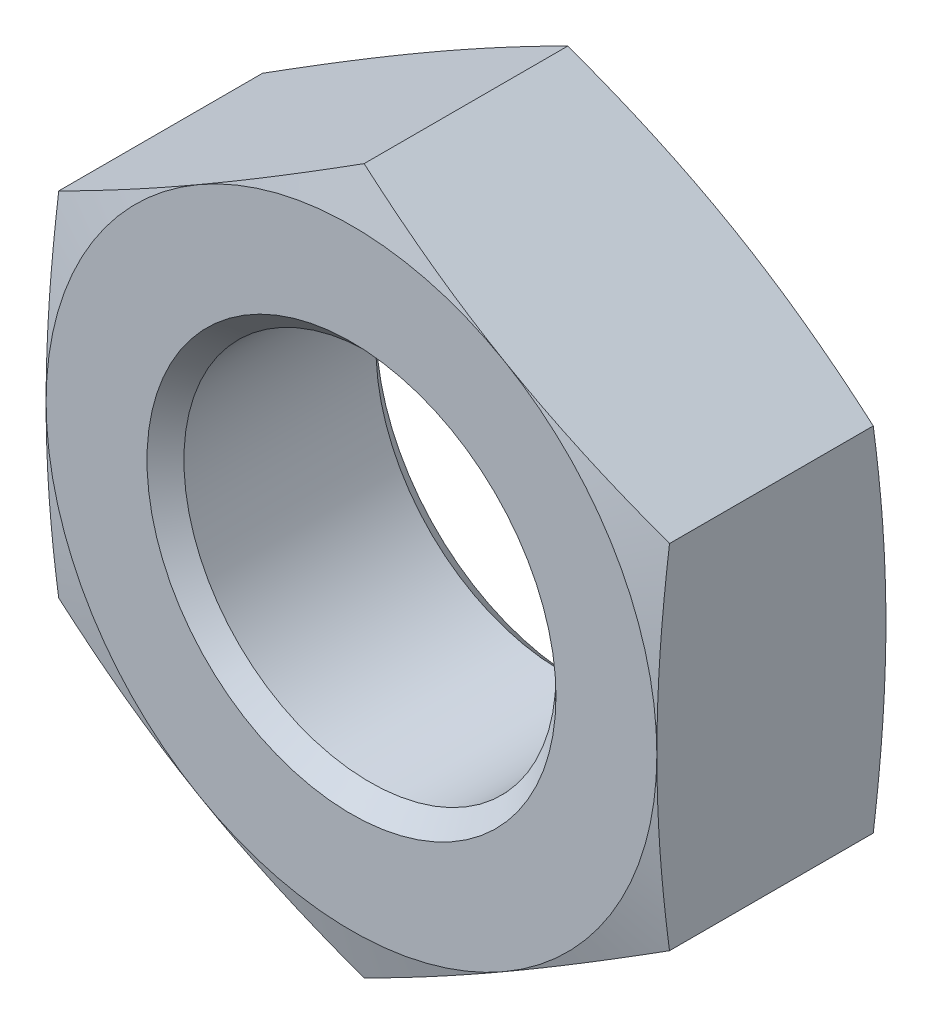
ISO-10303-21;
HEADER;
FILE_DESCRIPTION(('STEP AP214'),'2;1');
FILE_NAME('part.step','',(''),(''),'','','');
FILE_SCHEMA(('AUTOMOTIVE_DESIGN { 1 0 10303 214 1 1 1 1 }'));
ENDSEC;
DATA;
#1=APPLICATION_CONTEXT('core data for automotive mechanical design processes');
#2=APPLICATION_PROTOCOL_DEFINITION('international standard','automotive_design',2000,#1);
#3=PRODUCT_CONTEXT('',#1,'mechanical');
#4=PRODUCT('Part','Part','',(#3));
#5=PRODUCT_RELATED_PRODUCT_CATEGORY('part','',(#4));
#6=PRODUCT_DEFINITION_FORMATION('','',#4);
#7=PRODUCT_DEFINITION_CONTEXT('part definition',#1,'design');
#8=PRODUCT_DEFINITION('design','',#6,#7);
#9=PRODUCT_DEFINITION_SHAPE('','',#8);
#10=(LENGTH_UNIT() NAMED_UNIT(*) SI_UNIT(.MILLI.,.METRE.));
#11=(NAMED_UNIT(*) PLANE_ANGLE_UNIT() SI_UNIT($,.RADIAN.));
#12=(NAMED_UNIT(*) SI_UNIT($,.STERADIAN.) SOLID_ANGLE_UNIT());
#13=UNCERTAINTY_MEASURE_WITH_UNIT(LENGTH_MEASURE(1.E-05),#10,'distance_accuracy_value','');
#14=(GEOMETRIC_REPRESENTATION_CONTEXT(3) GLOBAL_UNCERTAINTY_ASSIGNED_CONTEXT((#13)) GLOBAL_UNIT_ASSIGNED_CONTEXT((#10,
#11,#12)) REPRESENTATION_CONTEXT('',''));
#15=CARTESIAN_POINT('',(0.,0.,0.));
#16=DIRECTION('',(0.,0.,1.));
#17=DIRECTION('',(1.,0.,0.));
#18=AXIS2_PLACEMENT_3D('',#15,#16,#17);
#19=CARTESIAN_POINT('',(0.,0.,0.));
#20=DIRECTION('',(0.,0.,-1.));
#21=DIRECTION('',(-1.,0.,0.));
#22=AXIS2_PLACEMENT_3D('',#19,#20,#21);
#23=PLANE('',#22);
#24=CARTESIAN_POINT('',(0.,0.,0.));
#25=DIRECTION('',(0.,0.,1.));
#26=DIRECTION('',(1.,0.,0.));
#27=AXIS2_PLACEMENT_3D('',#24,#25,#26);
#28=CIRCLE('',#27,14.224);
#29=CARTESIAN_POINT('',(14.224,0.,0.));
#30=VERTEX_POINT('',#29);
#31=CARTESIAN_POINT('',(7.11199999999961,12.3183453434298,0.));
#32=VERTEX_POINT('',#31);
#33=EDGE_CURVE('E11',#30,#32,#28,.T.);
#34=ORIENTED_EDGE('',*,*,#33,.T.);
#35=CARTESIAN_POINT('',(-7.11199999999961,12.3183453434298,0.));
#36=VERTEX_POINT('',#35);
#37=EDGE_CURVE('E44',#32,#36,#28,.T.);
#38=ORIENTED_EDGE('',*,*,#37,.T.);
#39=CARTESIAN_POINT('',(-14.224,0.,0.));
#40=VERTEX_POINT('',#39);
#41=EDGE_CURVE('E329',#36,#40,#28,.T.);
#42=ORIENTED_EDGE('',*,*,#41,.T.);
#43=CARTESIAN_POINT('',(-7.11199999999961,-12.3183453434298,0.));
#44=VERTEX_POINT('',#43);
#45=EDGE_CURVE('E322',#40,#44,#28,.T.);
#46=ORIENTED_EDGE('',*,*,#45,.T.);
#47=CARTESIAN_POINT('',(7.11199999999961,-12.3183453434298,0.));
#48=VERTEX_POINT('',#47);
#49=EDGE_CURVE('E325',#44,#48,#28,.T.);
#50=ORIENTED_EDGE('',*,*,#49,.T.);
#51=EDGE_CURVE('E45',#48,#30,#28,.T.);
#52=ORIENTED_EDGE('',*,*,#51,.T.);
#53=EDGE_LOOP('',(#34,#38,#42,#46,#50,#52));
#54=FACE_BOUND('',#53,.T.);
#55=CARTESIAN_POINT('',(0.,0.,0.));
#56=DIRECTION('',(0.,0.,1.));
#57=DIRECTION('',(1.,0.,0.));
#58=AXIS2_PLACEMENT_3D('',#55,#56,#57);
#59=CIRCLE('',#58,9.525);
#60=CARTESIAN_POINT('',(9.525,0.,0.));
#61=VERTEX_POINT('',#60);
#62=EDGE_CURVE('E186',#61,#61,#59,.T.);
#63=ORIENTED_EDGE('',*,*,#62,.F.);
#64=EDGE_LOOP('',(#63));
#65=FACE_BOUND('',#64,.T.);
#66=ADVANCED_FACE('F37',(#54,#65),#23,.F.);
#67=CARTESIAN_POINT('',(0.,14.224,-10.668));
#68=DIRECTION('',(0.,0.,1.));
#69=DIRECTION('',(1.,0.,0.));
#70=AXIS2_PLACEMENT_3D('',#67,#68,#69);
#71=PLANE('',#70);
#72=CARTESIAN_POINT('',(0.,0.,-10.668));
#73=DIRECTION('',(0.,0.,1.));
#74=DIRECTION('',(1.,0.,0.));
#75=AXIS2_PLACEMENT_3D('',#72,#73,#74);
#76=CIRCLE('',#75,14.224);
#77=CARTESIAN_POINT('',(14.224,0.,-10.668));
#78=VERTEX_POINT('',#77);
#79=CARTESIAN_POINT('',(7.11199999999961,12.3183453434298,-10.668));
#80=VERTEX_POINT('',#79);
#81=EDGE_CURVE('E360',#78,#80,#76,.T.);
#82=ORIENTED_EDGE('',*,*,#81,.F.);
#83=CARTESIAN_POINT('',(7.1119999999996,-12.3183453434298,-10.668));
#84=VERTEX_POINT('',#83);
#85=EDGE_CURVE('E363',#84,#78,#76,.T.);
#86=ORIENTED_EDGE('',*,*,#85,.F.);
#87=CARTESIAN_POINT('',(-7.1119999999996,-12.3183453434298,-10.668));
#88=VERTEX_POINT('',#87);
#89=EDGE_CURVE('E364',#88,#84,#76,.T.);
#90=ORIENTED_EDGE('',*,*,#89,.F.);
#91=CARTESIAN_POINT('',(-14.224,0.,-10.668));
#92=VERTEX_POINT('',#91);
#93=EDGE_CURVE('E144',#92,#88,#76,.T.);
#94=ORIENTED_EDGE('',*,*,#93,.F.);
#95=CARTESIAN_POINT('',(-7.11199999999961,12.3183453434298,-10.668));
#96=VERTEX_POINT('',#95);
#97=EDGE_CURVE('E361',#96,#92,#76,.T.);
#98=ORIENTED_EDGE('',*,*,#97,.F.);
#99=EDGE_CURVE('E357',#80,#96,#76,.T.);
#100=ORIENTED_EDGE('',*,*,#99,.F.);
#101=EDGE_LOOP('',(#82,#86,#90,#94,#98,#100));
#102=FACE_BOUND('',#101,.T.);
#103=CARTESIAN_POINT('',(0.,0.,-10.668));
#104=DIRECTION('',(0.,0.,1.));
#105=DIRECTION('',(1.,0.,0.));
#106=AXIS2_PLACEMENT_3D('',#103,#104,#105);
#107=CIRCLE('',#106,9.525);
#108=CARTESIAN_POINT('',(9.525,0.,-10.668));
#109=VERTEX_POINT('',#108);
#110=EDGE_CURVE('E206',#109,#109,#107,.T.);
#111=ORIENTED_EDGE('',*,*,#110,.T.);
#112=EDGE_LOOP('',(#111));
#113=FACE_BOUND('',#112,.T.);
#114=ADVANCED_FACE('F210',(#102,#113),#71,.F.);
#115=CARTESIAN_POINT('',(0.,0.,-0.76226186262806));
#116=DIRECTION('',(0.,0.,-1.));
#117=DIRECTION('',(-1.,0.,0.));
#118=AXIS2_PLACEMENT_3D('',#115,#116,#117);
#119=CONICAL_SURFACE('',#118,17.0688,1.30899693899575);
#120=CARTESIAN_POINT('',(-14.2242,8.21211475889936,-0.589642543106609));
#121=CARTESIAN_POINT('',(-13.6334964017427,8.55315764036449,-0.498223869578172));
#122=CARTESIAN_POINT('',(-13.0417218233648,8.89481885249051,-0.415230941104795));
#123=CARTESIAN_POINT('',(-11.8560828650969,9.57934782420813,-0.269420318898556));
#124=CARTESIAN_POINT('',(-11.2622177351571,9.92221601684124,-0.206610819128363));
#125=CARTESIAN_POINT('',(-10.0759981081415,10.6070802378167,-0.104833676719914));
#126=CARTESIAN_POINT('',(-9.48365163147777,10.949071635572,-0.0657446660571715));
#127=CARTESIAN_POINT('',(-8.29820332430729,11.6334905348272,-0.0133303197757476));
#128=CARTESIAN_POINT('',(-7.70510166215365,11.9759179391284,0.));
#129=CARTESIAN_POINT('',(-6.51889833784636,12.6607727477308,0.));
#130=CARTESIAN_POINT('',(-5.92579667569271,13.003200152032,-0.0133303197757232));
#131=CARTESIAN_POINT('',(-4.74034836852223,13.6876190512872,-0.0657446660571245));
#132=CARTESIAN_POINT('',(-4.14800189185852,14.0296104490425,-0.104833676719856));
#133=CARTESIAN_POINT('',(-2.96178226484294,14.714474670018,-0.206610819128284));
#134=CARTESIAN_POINT('',(-2.36791713490306,15.0573428626511,-0.269420318898467));
#135=CARTESIAN_POINT('',(-1.1822781766352,15.7418718343687,-0.415230941104688));
#136=CARTESIAN_POINT('',(-0.590503598257328,16.0835330464947,-0.498223869578057));
#137=CARTESIAN_POINT('',(0.00020000000000094,16.4245759279598,-0.589642543106487));
#138=B_SPLINE_CURVE_WITH_KNOTS('',3,(#120,#121,#122,#123,#124,#125,#126,#127,#128,#129,#130,
#131,#132,#133,#134,#135,#136,#137),.UNSPECIFIED.,.F.,.F.,(4,2,2,2,2,2,2,2,4),(0.,
2.06466265366888,4.13016245240679,6.18500281326287,8.23944553461129,10.2938882559597,
12.3487286168158,14.4142284155537,16.4788910692226),.UNSPECIFIED.);
#139=CARTESIAN_POINT('',(-14.224,8.2122302289532,-0.589611602672655));
#140=VERTEX_POINT('',#139);
#141=EDGE_CURVE('E337',#140,#36,#138,.T.);
#142=ORIENTED_EDGE('',*,*,#141,.F.);
#143=CARTESIAN_POINT('',(-14.224,-21.7243807604496,-3.14645413575293));
#144=CARTESIAN_POINT('',(-14.224,-21.0790787612579,-3.00183393647005));
#145=CARTESIAN_POINT('',(-14.224,-20.4333731459328,-2.85898244881792));
#146=CARTESIAN_POINT('',(-14.224,-19.1409564615723,-2.57777160403007));
#147=CARTESIAN_POINT('',(-14.224,-18.4942453503731,-2.43941244090478));
#148=CARTESIAN_POINT('',(-14.224,-17.199040133486,-2.16802054757932));
#149=CARTESIAN_POINT('',(-14.224,-16.5505449010764,-2.03499317547352));
#150=CARTESIAN_POINT('',(-14.224,-15.2522046555058,-1.77570075021796));
#151=CARTESIAN_POINT('',(-14.224,-14.6023596537847,-1.64943563999562));
#152=CARTESIAN_POINT('',(-14.224,-13.3062760588027,-1.40625269348093));
#153=CARTESIAN_POINT('',(-14.224,-12.6600499999559,-1.28926838124654));
#154=CARTESIAN_POINT('',(-14.224,-11.3658185538719,-1.06551002281259));
#155=CARTESIAN_POINT('',(-14.224,-10.7178131600359,-0.958736014531763));
#156=CARTESIAN_POINT('',(-14.224,-9.41992214696963,-0.757807134861831));
#157=CARTESIAN_POINT('',(-14.224,-8.77003679563019,-0.663650548053401));
#158=CARTESIAN_POINT('',(-14.224,-7.468198029404,-0.490729536189705));
#159=CARTESIAN_POINT('',(-14.224,-6.81624461258036,-0.411965125554683));
#160=CARTESIAN_POINT('',(-14.224,-5.50291447073282,-0.272058791497629));
#161=CARTESIAN_POINT('',(-14.224,-4.8415149523263,-0.211127659016756));
#162=CARTESIAN_POINT('',(-14.224,-3.51705314697331,-0.111091250559055));
#163=CARTESIAN_POINT('',(-14.224,-2.85399089851028,-0.0719854740391221));
#164=CARTESIAN_POINT('',(-14.224,-1.52716546567764,-0.0178805842010804));
#165=CARTESIAN_POINT('',(-14.224,-0.863402737208036,-0.0028705159154332));
#166=CARTESIAN_POINT('',(-14.224,0.464218175297371,0.002120109022077));
#167=CARTESIAN_POINT('',(-14.224,1.1280763592504,-0.0078993127495879));
#168=CARTESIAN_POINT('',(-14.224,2.45737110056316,-0.0524042115785588));
#169=CARTESIAN_POINT('',(-14.224,3.1228046242452,-0.0869784855320352));
#170=CARTESIAN_POINT('',(-14.224,4.4521067280568,-0.178619531809773));
#171=CARTESIAN_POINT('',(-14.224,5.11597527321198,-0.235686802105959));
#172=CARTESIAN_POINT('',(-14.224,6.44214183162605,-0.369431212169284));
#173=CARTESIAN_POINT('',(-14.224,7.10443853417782,-0.44612114943521));
#174=CARTESIAN_POINT('',(-14.224,8.42690051036191,-0.615919714969843));
#175=CARTESIAN_POINT('',(-14.224,9.08706577729564,-0.709028394787601));
#176=CARTESIAN_POINT('',(-14.224,10.3616881419258,-0.902075903202118));
#177=CARTESIAN_POINT('',(-14.224,10.9762769243492,-1.00115404522787));
#178=CARTESIAN_POINT('',(-14.224,12.2038347725701,-1.2089269149949));
#179=CARTESIAN_POINT('',(-14.224,12.816803793707,-1.31762190510449));
#180=CARTESIAN_POINT('',(-14.224,14.0413523417607,-1.54287313226601));
#181=CARTESIAN_POINT('',(-14.224,14.6529317224949,-1.65943016007505));
#182=CARTESIAN_POINT('',(-14.224,15.8748232687543,-1.89895612856139));
#183=CARTESIAN_POINT('',(-14.224,16.4851354456942,-2.02192501121958));
#184=CARTESIAN_POINT('',(-14.224,17.7048200333045,-2.27314775295765));
#185=CARTESIAN_POINT('',(-14.224,18.3141921846005,-2.40140286773506));
#186=CARTESIAN_POINT('',(-14.224,19.5320078526129,-2.66224393898536));
#187=CARTESIAN_POINT('',(-14.224,20.1404513678453,-2.79482990237158));
#188=CARTESIAN_POINT('',(-14.224,21.3565052633747,-3.06358133589582));
#189=CARTESIAN_POINT('',(-14.224,21.964115694423,-3.19974657676952));
#190=CARTESIAN_POINT('',(-14.224,23.1786575662446,-3.47507499569198));
#191=CARTESIAN_POINT('',(-14.224,23.7855890052031,-3.61423818173312));
#192=CARTESIAN_POINT('',(-14.224,25.5935865451477,-4.03272204491187));
#193=CARTESIAN_POINT('',(-14.224,26.7938060998848,-4.31569985289214));
#194=CARTESIAN_POINT('',(-14.224,29.1925719627601,-4.88872703273703));
#195=CARTESIAN_POINT('',(-14.224,30.3911182399946,-5.17877653342865));
#196=CARTESIAN_POINT('',(-14.224,32.7854479961846,-5.76376628828304));
#197=CARTESIAN_POINT('',(-14.224,33.9812330593344,-6.05870006542956));
#198=CARTESIAN_POINT('',(-14.224,35.774148367509,-6.50408039658097));
#199=CARTESIAN_POINT('',(-14.224,36.3716501445452,-6.65303469632044));
#200=CARTESIAN_POINT('',(-14.224,37.5664329007948,-6.95182359424588));
#201=CARTESIAN_POINT('',(-14.224,38.1637138802456,-7.10165819148267));
#202=CARTESIAN_POINT('',(-14.224,38.7608985394636,-7.25187587206677));
#203=B_SPLINE_CURVE_WITH_KNOTS('',3,(#143,#144,#145,#146,#147,#148,#149,#150,#151,#152,#153,
#154,#155,#156,#157,#158,#159,#160,#161,#162,#163,#164,#165,#166,#167,#168,#169,#170,#171,#172,
#173,#174,#175,#176,#177,#178,#179,#180,#181,#182,#183,#184,#185,#186,#187,#188,#189,#190,#191,
#192,#193,#194,#195,#196,#197,#198,#199,#200,#201,#202),.UNSPECIFIED.,.F.,.F.,(4,2,2,2,2,2,2,2,
2,2,2,2,2,2,2,2,2,2,2,2,2,2,2,2,2,2,2,2,2,4),(0.,1.98393525298285,3.96795607269393,
5.95392311482308,7.93987339301165,9.90999601510796,11.8801259535033,13.8499877677621,
15.8198514274878,17.8121368736914,19.8043766269071,21.7957103636219,23.7870423837239,
25.7856125017568,27.7842268685726,29.7841480276553,31.7840754658958,33.651556820601,
35.5190891399367,37.3868095749859,39.2545131124777,41.1226628925537,42.9908156549023,
44.8588490462023,46.7268874182071,50.4262355105997,54.1256510454769,57.820501401386,
59.6678671098419,61.515230826727),.UNSPECIFIED.);
#204=EDGE_CURVE('E155',#40,#140,#203,.T.);
#205=ORIENTED_EDGE('',*,*,#204,.F.);
#206=ORIENTED_EDGE('',*,*,#41,.F.);
#207=EDGE_LOOP('',(#142,#205,#206));
#208=FACE_BOUND('',#207,.T.);
#209=ADVANCED_FACE('F228',(#208),#119,.T.);
#210=CARTESIAN_POINT('',(0.,16.424460457906,-0.589611602672533));
#211=VERTEX_POINT('',#210);
#212=EDGE_CURVE('E334',#36,#211,#138,.T.);
#213=ORIENTED_EDGE('',*,*,#212,.F.);
#214=ORIENTED_EDGE('',*,*,#37,.F.);
#215=CARTESIAN_POINT('',(-0.0002,16.4245759279598,-0.589642543106487));
#216=CARTESIAN_POINT('',(0.590503598257331,16.0835330464947,-0.498223869578057));
#217=CARTESIAN_POINT('',(1.1822781766352,15.7418718343687,-0.415230941104688));
#218=CARTESIAN_POINT('',(2.36791713490306,15.0573428626511,-0.269420318898467));
#219=CARTESIAN_POINT('',(2.96178226484294,14.714474670018,-0.206610819128284));
#220=CARTESIAN_POINT('',(4.14800189185852,14.0296104490425,-0.104833676719856));
#221=CARTESIAN_POINT('',(4.74034836852223,13.6876190512872,-0.0657446660571243));
#222=CARTESIAN_POINT('',(5.92579667569271,13.003200152032,-0.0133303197757233));
#223=CARTESIAN_POINT('',(6.51889833784636,12.6607727477308,0.));
#224=CARTESIAN_POINT('',(7.70510166215365,11.9759179391284,0.));
#225=CARTESIAN_POINT('',(8.29820332430729,11.6334905348272,-0.0133303197757474));
#226=CARTESIAN_POINT('',(9.48365163147777,10.949071635572,-0.0657446660571714));
#227=CARTESIAN_POINT('',(10.0759981081415,10.6070802378167,-0.104833676719914));
#228=CARTESIAN_POINT('',(11.2622177351571,9.92221601684124,-0.206610819128363));
#229=CARTESIAN_POINT('',(11.8560828650969,9.57934782420813,-0.269420318898556));
#230=CARTESIAN_POINT('',(13.0417218233648,8.89481885249051,-0.415230941104795));
#231=CARTESIAN_POINT('',(13.6334964017427,8.55315764036449,-0.498223869578172));
#232=CARTESIAN_POINT('',(14.2242,8.21211475889936,-0.589642543106609));
#233=B_SPLINE_CURVE_WITH_KNOTS('',3,(#215,#216,#217,#218,#219,#220,#221,#222,#223,#224,#225,
#226,#227,#228,#229,#230,#231,#232),.UNSPECIFIED.,.F.,.F.,(4,2,2,2,2,2,2,2,4),(0.,
2.06466265366888,4.13016245240679,6.18500281326287,8.2394455346113,10.2938882559597,
12.3487286168158,14.4142284155537,16.4788910692226),.UNSPECIFIED.);
#234=EDGE_CURVE('E267',#211,#32,#233,.T.);
#235=ORIENTED_EDGE('',*,*,#234,.F.);
#236=EDGE_LOOP('',(#213,#214,#235));
#237=FACE_BOUND('',#236,.T.);
#238=ADVANCED_FACE('F276',(#237),#119,.T.);
#239=CARTESIAN_POINT('',(14.224,8.2122302289532,-0.589611602672655));
#240=VERTEX_POINT('',#239);
#241=EDGE_CURVE('E262',#32,#240,#233,.T.);
#242=ORIENTED_EDGE('',*,*,#241,.F.);
#243=ORIENTED_EDGE('',*,*,#33,.F.);
#244=CARTESIAN_POINT('',(14.224,-21.7243807604496,-3.14645413575293));
#245=CARTESIAN_POINT('',(14.224,-21.0790787612579,-3.00183393647005));
#246=CARTESIAN_POINT('',(14.224,-20.4333731459328,-2.85898244881792));
#247=CARTESIAN_POINT('',(14.224,-19.1409564615723,-2.57777160403007));
#248=CARTESIAN_POINT('',(14.224,-18.4942453503731,-2.43941244090478));
#249=CARTESIAN_POINT('',(14.224,-17.199040133486,-2.16802054757932));
#250=CARTESIAN_POINT('',(14.224,-16.5505449010764,-2.03499317547352));
#251=CARTESIAN_POINT('',(14.224,-15.2522046555058,-1.77570075021796));
#252=CARTESIAN_POINT('',(14.224,-14.6023596537847,-1.64943563999562));
#253=CARTESIAN_POINT('',(14.224,-13.3062760588027,-1.40625269348093));
#254=CARTESIAN_POINT('',(14.224,-12.6600499999559,-1.28926838124654));
#255=CARTESIAN_POINT('',(14.224,-11.3658185538719,-1.06551002281259));
#256=CARTESIAN_POINT('',(14.224,-10.7178131600359,-0.958736014531763));
#257=CARTESIAN_POINT('',(14.224,-9.41992214696963,-0.757807134861831));
#258=CARTESIAN_POINT('',(14.224,-8.77003679563019,-0.663650548053401));
#259=CARTESIAN_POINT('',(14.224,-7.468198029404,-0.490729536189705));
#260=CARTESIAN_POINT('',(14.224,-6.81624461258036,-0.411965125554683));
#261=CARTESIAN_POINT('',(14.224,-5.50291447073282,-0.272058791497629));
#262=CARTESIAN_POINT('',(14.224,-4.8415149523263,-0.211127659016756));
#263=CARTESIAN_POINT('',(14.224,-3.51705314697331,-0.111091250559055));
#264=CARTESIAN_POINT('',(14.224,-2.85399089851028,-0.0719854740391221));
#265=CARTESIAN_POINT('',(14.224,-1.52716546567764,-0.0178805842010804));
#266=CARTESIAN_POINT('',(14.224,-0.863402737208036,-0.0028705159154332));
#267=CARTESIAN_POINT('',(14.224,0.464218175297371,0.002120109022077));
#268=CARTESIAN_POINT('',(14.224,1.1280763592504,-0.0078993127495879));
#269=CARTESIAN_POINT('',(14.224,2.45737110056316,-0.0524042115785588));
#270=CARTESIAN_POINT('',(14.224,3.1228046242452,-0.0869784855320352));
#271=CARTESIAN_POINT('',(14.224,4.4521067280568,-0.178619531809773));
#272=CARTESIAN_POINT('',(14.224,5.11597527321198,-0.235686802105959));
#273=CARTESIAN_POINT('',(14.224,6.44214183162605,-0.369431212169284));
#274=CARTESIAN_POINT('',(14.224,7.10443853417782,-0.44612114943521));
#275=CARTESIAN_POINT('',(14.224,8.42690051036191,-0.615919714969843));
#276=CARTESIAN_POINT('',(14.224,9.08706577729564,-0.709028394787601));
#277=CARTESIAN_POINT('',(14.224,10.3616881419258,-0.902075903202118));
#278=CARTESIAN_POINT('',(14.224,10.9762769243492,-1.00115404522787));
#279=CARTESIAN_POINT('',(14.224,12.2038347725701,-1.2089269149949));
#280=CARTESIAN_POINT('',(14.224,12.816803793707,-1.31762190510449));
#281=CARTESIAN_POINT('',(14.224,14.0413523417607,-1.54287313226601));
#282=CARTESIAN_POINT('',(14.224,14.6529317224949,-1.65943016007505));
#283=CARTESIAN_POINT('',(14.224,15.8748232687543,-1.89895612856139));
#284=CARTESIAN_POINT('',(14.224,16.4851354456942,-2.02192501121958));
#285=CARTESIAN_POINT('',(14.224,17.7048200333045,-2.27314775295765));
#286=CARTESIAN_POINT('',(14.224,18.3141921846005,-2.40140286773506));
#287=CARTESIAN_POINT('',(14.224,19.5320078526129,-2.66224393898536));
#288=CARTESIAN_POINT('',(14.224,20.1404513678453,-2.79482990237158));
#289=CARTESIAN_POINT('',(14.224,21.3565052633747,-3.06358133589582));
#290=CARTESIAN_POINT('',(14.224,21.964115694423,-3.19974657676952));
#291=CARTESIAN_POINT('',(14.224,23.1786575662446,-3.47507499569198));
#292=CARTESIAN_POINT('',(14.224,23.7855890052031,-3.61423818173312));
#293=CARTESIAN_POINT('',(14.224,25.5935865451477,-4.03272204491187));
#294=CARTESIAN_POINT('',(14.224,26.7938060998848,-4.31569985289214));
#295=CARTESIAN_POINT('',(14.224,29.1925719627601,-4.88872703273703));
#296=CARTESIAN_POINT('',(14.224,30.3911182399946,-5.17877653342865));
#297=CARTESIAN_POINT('',(14.224,32.7854479961846,-5.76376628828304));
#298=CARTESIAN_POINT('',(14.224,33.9812330593344,-6.05870006542956));
#299=CARTESIAN_POINT('',(14.224,35.774148367509,-6.50408039658097));
#300=CARTESIAN_POINT('',(14.224,36.3716501445452,-6.65303469632044));
#301=CARTESIAN_POINT('',(14.224,37.5664329007948,-6.95182359424588));
#302=CARTESIAN_POINT('',(14.224,38.1637138802456,-7.10165819148267));
#303=CARTESIAN_POINT('',(14.224,38.7608985394636,-7.25187587206677));
#304=B_SPLINE_CURVE_WITH_KNOTS('',3,(#244,#245,#246,#247,#248,#249,#250,#251,#252,#253,#254,
#255,#256,#257,#258,#259,#260,#261,#262,#263,#264,#265,#266,#267,#268,#269,#270,#271,#272,#273,
#274,#275,#276,#277,#278,#279,#280,#281,#282,#283,#284,#285,#286,#287,#288,#289,#290,#291,#292,
#293,#294,#295,#296,#297,#298,#299,#300,#301,#302,#303),.UNSPECIFIED.,.F.,.F.,(4,2,2,2,2,2,2,2,
2,2,2,2,2,2,2,2,2,2,2,2,2,2,2,2,2,2,2,2,2,4),(0.,1.98393525298285,3.96795607269393,
5.95392311482308,7.93987339301165,9.90999601510796,11.8801259535033,13.8499877677621,
15.8198514274878,17.8121368736914,19.8043766269071,21.7957103636219,23.7870423837239,
25.7856125017568,27.7842268685726,29.7841480276553,31.7840754658958,33.651556820601,
35.5190891399367,37.3868095749859,39.2545131124777,41.1226628925537,42.9908156549023,
44.8588490462023,46.7268874182071,50.4262355105997,54.1256510454769,57.820501401386,
59.6678671098419,61.515230826727),.UNSPECIFIED.);
#305=EDGE_CURVE('E294',#240,#30,#304,.F.);
#306=ORIENTED_EDGE('',*,*,#305,.F.);
#307=EDGE_LOOP('',(#242,#243,#306));
#308=FACE_BOUND('',#307,.T.);
#309=ADVANCED_FACE('F348',(#308),#119,.T.);
#310=CARTESIAN_POINT('',(14.224,-8.2122302289532,-0.589611602672655));
#311=VERTEX_POINT('',#310);
#312=EDGE_CURVE('E290',#30,#311,#304,.F.);
#313=ORIENTED_EDGE('',*,*,#312,.F.);
#314=ORIENTED_EDGE('',*,*,#51,.F.);
#315=CARTESIAN_POINT('',(14.2242,-8.21211475889936,-0.589642543106609));
#316=CARTESIAN_POINT('',(13.6334964017427,-8.55315764036449,-0.498223869578172));
#317=CARTESIAN_POINT('',(13.0417218233648,-8.89481885249051,-0.415230941104795));
#318=CARTESIAN_POINT('',(11.8560828650969,-9.57934782420813,-0.269420318898556));
#319=CARTESIAN_POINT('',(11.2622177351571,-9.92221601684124,-0.206610819128363));
#320=CARTESIAN_POINT('',(10.0759981081415,-10.6070802378167,-0.104833676719914));
#321=CARTESIAN_POINT('',(9.48365163147777,-10.949071635572,-0.0657446660571715));
#322=CARTESIAN_POINT('',(8.29820332430729,-11.6334905348272,-0.0133303197757476));
#323=CARTESIAN_POINT('',(7.70510166215365,-11.9759179391284,0.));
#324=CARTESIAN_POINT('',(6.51889833784636,-12.6607727477308,0.));
#325=CARTESIAN_POINT('',(5.92579667569271,-13.003200152032,-0.0133303197757232));
#326=CARTESIAN_POINT('',(4.74034836852223,-13.6876190512872,-0.0657446660571245));
#327=CARTESIAN_POINT('',(4.14800189185852,-14.0296104490425,-0.104833676719856));
#328=CARTESIAN_POINT('',(2.96178226484294,-14.714474670018,-0.206610819128284));
#329=CARTESIAN_POINT('',(2.36791713490306,-15.0573428626511,-0.269420318898467));
#330=CARTESIAN_POINT('',(1.1822781766352,-15.7418718343687,-0.415230941104688));
#331=CARTESIAN_POINT('',(0.590503598257328,-16.0835330464947,-0.498223869578057));
#332=CARTESIAN_POINT('',(-0.00020000000000094,-16.4245759279598,-0.589642543106487));
#333=B_SPLINE_CURVE_WITH_KNOTS('',3,(#315,#316,#317,#318,#319,#320,#321,#322,#323,#324,#325,
#326,#327,#328,#329,#330,#331,#332),.UNSPECIFIED.,.F.,.F.,(4,2,2,2,2,2,2,2,4),(0.,
2.06466265366888,4.13016245240679,6.18500281326287,8.23944553461129,10.2938882559597,
12.3487286168158,14.4142284155537,16.4788910692226),.UNSPECIFIED.);
#334=EDGE_CURVE('E300',#311,#48,#333,.T.);
#335=ORIENTED_EDGE('',*,*,#334,.F.);
#336=EDGE_LOOP('',(#313,#314,#335));
#337=FACE_BOUND('',#336,.T.);
#338=ADVANCED_FACE('F388',(#337),#119,.T.);
#339=CARTESIAN_POINT('',(0.,-16.424460457906,-0.589611602672533));
#340=VERTEX_POINT('',#339);
#341=EDGE_CURVE('E285',#48,#340,#333,.T.);
#342=ORIENTED_EDGE('',*,*,#341,.F.);
#343=ORIENTED_EDGE('',*,*,#49,.F.);
#344=CARTESIAN_POINT('',(0.0002,-16.4245759279598,-0.589642543106487));
#345=CARTESIAN_POINT('',(-0.590503598257331,-16.0835330464947,-0.498223869578057));
#346=CARTESIAN_POINT('',(-1.1822781766352,-15.7418718343687,-0.415230941104688));
#347=CARTESIAN_POINT('',(-2.36791713490306,-15.0573428626511,-0.269420318898467));
#348=CARTESIAN_POINT('',(-2.96178226484294,-14.714474670018,-0.206610819128284));
#349=CARTESIAN_POINT('',(-4.14800189185852,-14.0296104490425,-0.104833676719856));
#350=CARTESIAN_POINT('',(-4.74034836852223,-13.6876190512872,-0.0657446660571243));
#351=CARTESIAN_POINT('',(-5.92579667569271,-13.003200152032,-0.0133303197757233));
#352=CARTESIAN_POINT('',(-6.51889833784636,-12.6607727477308,0.));
#353=CARTESIAN_POINT('',(-7.70510166215365,-11.9759179391284,0.));
#354=CARTESIAN_POINT('',(-8.29820332430729,-11.6334905348272,-0.0133303197757474));
#355=CARTESIAN_POINT('',(-9.48365163147777,-10.949071635572,-0.0657446660571714));
#356=CARTESIAN_POINT('',(-10.0759981081415,-10.6070802378167,-0.104833676719914));
#357=CARTESIAN_POINT('',(-11.2622177351571,-9.92221601684124,-0.206610819128363));
#358=CARTESIAN_POINT('',(-11.8560828650969,-9.57934782420813,-0.269420318898556));
#359=CARTESIAN_POINT('',(-13.0417218233648,-8.89481885249051,-0.415230941104795));
#360=CARTESIAN_POINT('',(-13.6334964017427,-8.55315764036449,-0.498223869578172));
#361=CARTESIAN_POINT('',(-14.2242,-8.21211475889936,-0.589642543106609));
#362=B_SPLINE_CURVE_WITH_KNOTS('',3,(#344,#345,#346,#347,#348,#349,#350,#351,#352,#353,#354,
#355,#356,#357,#358,#359,#360,#361),.UNSPECIFIED.,.F.,.F.,(4,2,2,2,2,2,2,2,4),(0.,
2.06466265366888,4.13016245240679,6.18500281326287,8.2394455346113,10.2938882559597,
12.3487286168158,14.4142284155537,16.4788910692226),.UNSPECIFIED.);
#363=EDGE_CURVE('E147',#340,#44,#362,.T.);
#364=ORIENTED_EDGE('',*,*,#363,.F.);
#365=EDGE_LOOP('',(#342,#343,#364));
#366=FACE_BOUND('',#365,.T.);
#367=ADVANCED_FACE('F326',(#366),#119,.T.);
#368=CARTESIAN_POINT('',(-14.224,-8.2122302289532,-0.589611602672655));
#369=VERTEX_POINT('',#368);
#370=EDGE_CURVE('E139',#44,#369,#362,.T.);
#371=ORIENTED_EDGE('',*,*,#370,.F.);
#372=ORIENTED_EDGE('',*,*,#45,.F.);
#373=EDGE_CURVE('E52',#369,#40,#203,.T.);
#374=ORIENTED_EDGE('',*,*,#373,.F.);
#375=EDGE_LOOP('',(#371,#372,#374));
#376=FACE_BOUND('',#375,.T.);
#377=ADVANCED_FACE('F278',(#376),#119,.T.);
#378=CARTESIAN_POINT('',(0.,16.424460457906,-10.668));
#379=DIRECTION('',(-0.49999999999998,0.86602540378445,0.));
#380=DIRECTION('',(-0.86602540378445,-0.49999999999998,0.));
#381=AXIS2_PLACEMENT_3D('',#378,#379,#380);
#382=PLANE('',#381);
#383=ORIENTED_EDGE('',*,*,#141,.T.);
#384=ORIENTED_EDGE('',*,*,#212,.T.);
#385=DIRECTION('',(0.,0.,1.));
#386=VECTOR('',#385,1.);
#387=CARTESIAN_POINT('',(0.,16.424460457906,-10.668));
#388=LINE('',#387,#386);
#389=CARTESIAN_POINT('',(0.,16.424460457906,-10.0783883973274));
#390=VERTEX_POINT('',#389);
#391=EDGE_CURVE('E132',#390,#211,#388,.T.);
#392=ORIENTED_EDGE('',*,*,#391,.F.);
#393=CARTESIAN_POINT('',(0.000200000000000137,16.4245759279598,-10.0783574568935));
#394=CARTESIAN_POINT('',(-0.59050359825733,16.0835330464947,-10.1697761304219));
#395=CARTESIAN_POINT('',(-1.1822781766352,15.7418718343687,-10.2527690588953));
#396=CARTESIAN_POINT('',(-2.36791713490306,15.0573428626511,-10.3985796811015));
#397=CARTESIAN_POINT('',(-2.96178226484294,14.714474670018,-10.4613891808717));
#398=CARTESIAN_POINT('',(-4.14800189185852,14.0296104490425,-10.5631663232801));
#399=CARTESIAN_POINT('',(-4.74034836852223,13.6876190512872,-10.6022553339429));
#400=CARTESIAN_POINT('',(-5.92579667569271,13.003200152032,-10.6546696802243));
#401=CARTESIAN_POINT('',(-6.51889833784636,12.6607727477308,-10.6680000000001));
#402=CARTESIAN_POINT('',(-7.70510166215365,11.9759179391284,-10.6680000000001));
#403=CARTESIAN_POINT('',(-8.29820332430729,11.6334905348272,-10.6546696802243));
#404=CARTESIAN_POINT('',(-9.48365163147777,10.949071635572,-10.6022553339428));
#405=CARTESIAN_POINT('',(-10.0759981081415,10.6070802378167,-10.5631663232801));
#406=CARTESIAN_POINT('',(-11.2622177351571,9.92221601684124,-10.4613891808716));
#407=CARTESIAN_POINT('',(-11.8560828650969,9.57934782420813,-10.3985796811014));
#408=CARTESIAN_POINT('',(-13.0417218233648,8.89481885249051,-10.2527690588952));
#409=CARTESIAN_POINT('',(-13.6334964017427,8.55315764036449,-10.1697761304218));
#410=CARTESIAN_POINT('',(-14.2242,8.21211475889936,-10.0783574568934));
#411=B_SPLINE_CURVE_WITH_KNOTS('',3,(#393,#394,#395,#396,#397,#398,#399,#400,#401,#402,#403,
#404,#405,#406,#407,#408,#409,#410),.UNSPECIFIED.,.F.,.F.,(4,2,2,2,2,2,2,2,4),(0.,
2.06466265366888,4.13016245240679,6.18500281326288,8.2394455346113,10.2938882559597,
12.3487286168158,14.4142284155537,16.4788910692226),.UNSPECIFIED.);
#412=EDGE_CURVE('E338',#390,#96,#411,.T.);
#413=ORIENTED_EDGE('',*,*,#412,.T.);
#414=CARTESIAN_POINT('',(-14.224,8.2122302289532,-10.0783883973273));
#415=VERTEX_POINT('',#414);
#416=EDGE_CURVE('E269',#96,#415,#411,.T.);
#417=ORIENTED_EDGE('',*,*,#416,.T.);
#418=DIRECTION('',(0.,0.,1.));
#419=VECTOR('',#418,1.);
#420=CARTESIAN_POINT('',(-14.224,8.2122302289532,-10.668));
#421=LINE('',#420,#419);
#422=EDGE_CURVE('E141',#415,#140,#421,.T.);
#423=ORIENTED_EDGE('',*,*,#422,.T.);
#424=EDGE_LOOP('',(#383,#384,#392,#413,#417,#423));
#425=FACE_BOUND('',#424,.T.);
#426=ADVANCED_FACE('F178',(#425),#382,.T.);
#427=CARTESIAN_POINT('',(14.224,8.2122302289532,-10.668));
#428=DIRECTION('',(0.49999999999998,0.86602540378445,0.));
#429=DIRECTION('',(-0.86602540378445,0.49999999999998,0.));
#430=AXIS2_PLACEMENT_3D('',#427,#428,#429);
#431=PLANE('',#430);
#432=ORIENTED_EDGE('',*,*,#234,.T.);
#433=ORIENTED_EDGE('',*,*,#241,.T.);
#434=DIRECTION('',(0.,0.,1.));
#435=VECTOR('',#434,1.);
#436=CARTESIAN_POINT('',(14.224,8.2122302289532,-10.668));
#437=LINE('',#436,#435);
#438=CARTESIAN_POINT('',(14.224,8.2122302289532,-10.0783883973273));
#439=VERTEX_POINT('',#438);
#440=EDGE_CURVE('E193',#439,#240,#437,.T.);
#441=ORIENTED_EDGE('',*,*,#440,.F.);
#442=CARTESIAN_POINT('',(14.2242,8.21211475889936,-10.0783574568934));
#443=CARTESIAN_POINT('',(13.6334964017427,8.55315764036449,-10.1697761304218));
#444=CARTESIAN_POINT('',(13.0417218233648,8.89481885249051,-10.2527690588952));
#445=CARTESIAN_POINT('',(11.8560828650969,9.57934782420813,-10.3985796811014));
#446=CARTESIAN_POINT('',(11.2622177351571,9.92221601684124,-10.4613891808716));
#447=CARTESIAN_POINT('',(10.0759981081415,10.6070802378167,-10.5631663232801));
#448=CARTESIAN_POINT('',(9.48365163147777,10.949071635572,-10.6022553339428));
#449=CARTESIAN_POINT('',(8.29820332430729,11.6334905348272,-10.6546696802243));
#450=CARTESIAN_POINT('',(7.70510166215365,11.9759179391284,-10.6680000000001));
#451=CARTESIAN_POINT('',(6.51889833784636,12.6607727477308,-10.6680000000001));
#452=CARTESIAN_POINT('',(5.92579667569271,13.003200152032,-10.6546696802243));
#453=CARTESIAN_POINT('',(4.74034836852223,13.6876190512872,-10.6022553339429));
#454=CARTESIAN_POINT('',(4.14800189185852,14.0296104490425,-10.5631663232801));
#455=CARTESIAN_POINT('',(2.96178226484294,14.714474670018,-10.4613891808717));
#456=CARTESIAN_POINT('',(2.36791713490306,15.0573428626511,-10.3985796811015));
#457=CARTESIAN_POINT('',(1.1822781766352,15.7418718343687,-10.2527690588953));
#458=CARTESIAN_POINT('',(0.590503598257328,16.0835330464947,-10.1697761304219));
#459=CARTESIAN_POINT('',(-0.000200000000001894,16.4245759279598,-10.0783574568935));
#460=B_SPLINE_CURVE_WITH_KNOTS('',3,(#442,#443,#444,#445,#446,#447,#448,#449,#450,#451,#452,
#453,#454,#455,#456,#457,#458,#459),.UNSPECIFIED.,.F.,.F.,(4,2,2,2,2,2,2,2,4),(0.,
2.06466265366888,4.13016245240679,6.18500281326287,8.2394455346113,10.2938882559597,
12.3487286168158,14.4142284155537,16.4788910692226),.UNSPECIFIED.);
#461=EDGE_CURVE('E268',#439,#80,#460,.T.);
#462=ORIENTED_EDGE('',*,*,#461,.T.);
#463=EDGE_CURVE('E256',#80,#390,#460,.T.);
#464=ORIENTED_EDGE('',*,*,#463,.T.);
#465=ORIENTED_EDGE('',*,*,#391,.T.);
#466=EDGE_LOOP('',(#432,#433,#441,#462,#464,#465));
#467=FACE_BOUND('',#466,.T.);
#468=ADVANCED_FACE('F248',(#467),#431,.T.);
#469=CARTESIAN_POINT('',(14.224,-8.2122302289532,-10.668));
#470=DIRECTION('',(1.,0.,0.));
#471=DIRECTION('',(0.,0.,-1.));
#472=AXIS2_PLACEMENT_3D('',#469,#470,#471);
#473=PLANE('',#472);
#474=ORIENTED_EDGE('',*,*,#305,.T.);
#475=ORIENTED_EDGE('',*,*,#312,.T.);
#476=DIRECTION('',(0.,0.,1.));
#477=VECTOR('',#476,1.);
#478=CARTESIAN_POINT('',(14.224,-8.2122302289532,-10.668));
#479=LINE('',#478,#477);
#480=CARTESIAN_POINT('',(14.224,-8.2122302289532,-10.0783883973273));
#481=VERTEX_POINT('',#480);
#482=EDGE_CURVE('E190',#481,#311,#479,.T.);
#483=ORIENTED_EDGE('',*,*,#482,.F.);
#484=CARTESIAN_POINT('',(14.224,-21.7243807604496,-7.5215458642469));
#485=CARTESIAN_POINT('',(14.224,-21.079078761258,-7.6661660635298));
#486=CARTESIAN_POINT('',(14.224,-20.4333731459328,-7.80901755118194));
#487=CARTESIAN_POINT('',(14.224,-19.1409564615723,-8.09022839596979));
#488=CARTESIAN_POINT('',(14.224,-18.4942453503731,-8.22858755909509));
#489=CARTESIAN_POINT('',(14.224,-17.199040133486,-8.49997945242056));
#490=CARTESIAN_POINT('',(14.224,-16.5505449010764,-8.63300682452638));
#491=CARTESIAN_POINT('',(14.224,-15.2522046555058,-8.89229924978195));
#492=CARTESIAN_POINT('',(14.224,-14.6023596537847,-9.01856436000429));
#493=CARTESIAN_POINT('',(14.224,-13.3062760588027,-9.26174730651899));
#494=CARTESIAN_POINT('',(14.224,-12.6600499999559,-9.37873161875339));
#495=CARTESIAN_POINT('',(14.224,-11.3658185538719,-9.60248997718735));
#496=CARTESIAN_POINT('',(14.224,-10.7178131600359,-9.70926398546819));
#497=CARTESIAN_POINT('',(14.224,-9.41992214696964,-9.91019286513813));
#498=CARTESIAN_POINT('',(14.224,-8.7700367956302,-10.0043494519466));
#499=CARTESIAN_POINT('',(14.224,-7.46819802940401,-10.1772704638103));
#500=CARTESIAN_POINT('',(14.224,-6.81624461258036,-10.2560348744453));
#501=CARTESIAN_POINT('',(14.224,-5.50291447073282,-10.3959412085024));
#502=CARTESIAN_POINT('',(14.224,-4.84151495232629,-10.4568723409832));
#503=CARTESIAN_POINT('',(14.224,-3.5170531469733,-10.5569087494409));
#504=CARTESIAN_POINT('',(14.224,-2.85399089851027,-10.5960145259609));
#505=CARTESIAN_POINT('',(14.224,-1.52716546567762,-10.6501194157989));
#506=CARTESIAN_POINT('',(14.224,-0.863402737208021,-10.6651294840846));
#507=CARTESIAN_POINT('',(14.224,0.464218175297389,-10.6701201090221));
#508=CARTESIAN_POINT('',(14.224,1.12807635925042,-10.6601006872504));
#509=CARTESIAN_POINT('',(14.224,2.45737110056318,-10.6155957884214));
#510=CARTESIAN_POINT('',(14.224,3.12280462424523,-10.581021514468));
#511=CARTESIAN_POINT('',(14.224,4.45210672805683,-10.4893804681902));
#512=CARTESIAN_POINT('',(14.224,5.115975273212,-10.432313197894));
#513=CARTESIAN_POINT('',(14.224,6.44214183162608,-10.2985687878307));
#514=CARTESIAN_POINT('',(14.224,7.10443853417785,-10.2218788505648));
#515=CARTESIAN_POINT('',(14.224,8.42690051036194,-10.0520802850301));
#516=CARTESIAN_POINT('',(14.224,9.08706577729567,-9.95897160521236));
#517=CARTESIAN_POINT('',(14.224,10.3616881419259,-9.76592409679783));
#518=CARTESIAN_POINT('',(14.224,10.9762769243492,-9.66684595477208));
#519=CARTESIAN_POINT('',(14.224,12.2038347725702,-9.45907308500503));
#520=CARTESIAN_POINT('',(14.224,12.8168037937071,-9.35037809489544));
#521=CARTESIAN_POINT('',(14.224,14.0413523417608,-9.1251268677339));
#522=CARTESIAN_POINT('',(14.224,14.6529317224949,-9.00856983992486));
#523=CARTESIAN_POINT('',(14.224,15.8748232687544,-8.76904387143851));
#524=CARTESIAN_POINT('',(14.224,16.4851354456943,-8.64607498878031));
#525=CARTESIAN_POINT('',(14.224,17.7048200333046,-8.39485224704223));
#526=CARTESIAN_POINT('',(14.224,18.3141921846006,-8.26659713226481));
#527=CARTESIAN_POINT('',(14.224,19.5320078526129,-8.0057560610145));
#528=CARTESIAN_POINT('',(14.224,20.1404513678453,-7.87317009762827));
#529=CARTESIAN_POINT('',(14.224,21.3565052633747,-7.60441866410402));
#530=CARTESIAN_POINT('',(14.224,21.964115694423,-7.46825342323031));
#531=CARTESIAN_POINT('',(14.224,23.1786575662446,-7.19292500430784));
#532=CARTESIAN_POINT('',(14.224,23.7855890052032,-7.0537618182667));
#533=CARTESIAN_POINT('',(14.224,25.5935865451478,-6.63527795508793));
#534=CARTESIAN_POINT('',(14.224,26.7938060998848,-6.35230014710764));
#535=CARTESIAN_POINT('',(14.224,29.1925719627601,-5.77927296726272));
#536=CARTESIAN_POINT('',(14.224,30.3911182399946,-5.48922346657109));
#537=CARTESIAN_POINT('',(14.224,32.7854479961846,-4.90423371171667));
#538=CARTESIAN_POINT('',(14.224,33.9812330593344,-4.60929993457014));
#539=CARTESIAN_POINT('',(14.224,35.774148367509,-4.1639196034187));
#540=CARTESIAN_POINT('',(14.224,36.3716501445452,-4.01496530367923));
#541=CARTESIAN_POINT('',(14.224,37.5664329007948,-3.71617640575377));
#542=CARTESIAN_POINT('',(14.224,38.1637138802456,-3.56634180851697));
#543=CARTESIAN_POINT('',(14.224,38.7608985394636,-3.41612412793287));
#544=B_SPLINE_CURVE_WITH_KNOTS('',3,(#484,#485,#486,#487,#488,#489,#490,#491,#492,#493,#494,
#495,#496,#497,#498,#499,#500,#501,#502,#503,#504,#505,#506,#507,#508,#509,#510,#511,#512,#513,
#514,#515,#516,#517,#518,#519,#520,#521,#522,#523,#524,#525,#526,#527,#528,#529,#530,#531,#532,
#533,#534,#535,#536,#537,#538,#539,#540,#541,#542,#543),.UNSPECIFIED.,.F.,.F.,(4,2,2,2,2,2,2,2,
2,2,2,2,2,2,2,2,2,2,2,2,2,2,2,2,2,2,2,2,2,4),(0.,1.98393525298285,3.96795607269394,
5.9539231148231,7.93987339301167,9.90999601510798,11.8801259535033,13.8499877677621,
15.8198514274879,17.8121368736914,19.8043766269072,21.795710363622,23.787042383724,
25.7856125017569,27.7842268685727,29.7841480276554,31.7840754658959,33.6515568206011,
35.5190891399368,37.386809574986,39.2545131124777,41.1226628925538,42.9908156549024,
44.8588490462024,46.7268874182072,50.4262355105998,54.125651045477,57.8205014013861,
59.667867109842,61.5152308267271),.UNSPECIFIED.);
#545=EDGE_CURVE('E295',#481,#78,#544,.T.);
#546=ORIENTED_EDGE('',*,*,#545,.T.);
#547=EDGE_CURVE('E296',#78,#439,#544,.T.);
#548=ORIENTED_EDGE('',*,*,#547,.T.);
#549=ORIENTED_EDGE('',*,*,#440,.T.);
#550=EDGE_LOOP('',(#474,#475,#483,#546,#548,#549));
#551=FACE_BOUND('',#550,.T.);
#552=ADVANCED_FACE('F251',(#551),#473,.T.);
#553=CARTESIAN_POINT('',(0.,-16.424460457906,-10.668));
#554=DIRECTION('',(0.49999999999998,-0.86602540378445,0.));
#555=DIRECTION('',(0.86602540378445,0.49999999999998,0.));
#556=AXIS2_PLACEMENT_3D('',#553,#554,#555);
#557=PLANE('',#556);
#558=ORIENTED_EDGE('',*,*,#334,.T.);
#559=ORIENTED_EDGE('',*,*,#341,.T.);
#560=DIRECTION('',(0.,0.,1.));
#561=VECTOR('',#560,1.);
#562=CARTESIAN_POINT('',(0.,-16.424460457906,-10.668));
#563=LINE('',#562,#561);
#564=CARTESIAN_POINT('',(0.,-16.424460457906,-10.0783883973274));
#565=VERTEX_POINT('',#564);
#566=EDGE_CURVE('E140',#565,#340,#563,.T.);
#567=ORIENTED_EDGE('',*,*,#566,.F.);
#568=CARTESIAN_POINT('',(-0.000200000000000137,-16.4245759279598,-10.0783574568935));
#569=CARTESIAN_POINT('',(0.59050359825733,-16.0835330464947,-10.1697761304219));
#570=CARTESIAN_POINT('',(1.1822781766352,-15.7418718343687,-10.2527690588953));
#571=CARTESIAN_POINT('',(2.36791713490306,-15.0573428626511,-10.3985796811015));
#572=CARTESIAN_POINT('',(2.96178226484294,-14.714474670018,-10.4613891808717));
#573=CARTESIAN_POINT('',(4.14800189185852,-14.0296104490425,-10.5631663232801));
#574=CARTESIAN_POINT('',(4.74034836852223,-13.6876190512872,-10.6022553339429));
#575=CARTESIAN_POINT('',(5.92579667569271,-13.003200152032,-10.6546696802243));
#576=CARTESIAN_POINT('',(6.51889833784636,-12.6607727477308,-10.6680000000001));
#577=CARTESIAN_POINT('',(7.70510166215365,-11.9759179391284,-10.6680000000001));
#578=CARTESIAN_POINT('',(8.29820332430729,-11.6334905348272,-10.6546696802243));
#579=CARTESIAN_POINT('',(9.48365163147777,-10.949071635572,-10.6022553339428));
#580=CARTESIAN_POINT('',(10.0759981081415,-10.6070802378167,-10.5631663232801));
#581=CARTESIAN_POINT('',(11.2622177351571,-9.92221601684124,-10.4613891808716));
#582=CARTESIAN_POINT('',(11.8560828650969,-9.57934782420813,-10.3985796811014));
#583=CARTESIAN_POINT('',(13.0417218233648,-8.89481885249051,-10.2527690588952));
#584=CARTESIAN_POINT('',(13.6334964017427,-8.55315764036449,-10.1697761304218));
#585=CARTESIAN_POINT('',(14.2242,-8.21211475889936,-10.0783574568934));
#586=B_SPLINE_CURVE_WITH_KNOTS('',3,(#568,#569,#570,#571,#572,#573,#574,#575,#576,#577,#578,
#579,#580,#581,#582,#583,#584,#585),.UNSPECIFIED.,.F.,.F.,(4,2,2,2,2,2,2,2,4),(0.,
2.06466265366888,4.13016245240679,6.18500281326288,8.2394455346113,10.2938882559597,
12.3487286168158,14.4142284155537,16.4788910692226),.UNSPECIFIED.);
#587=EDGE_CURVE('E307',#565,#84,#586,.T.);
#588=ORIENTED_EDGE('',*,*,#587,.T.);
#589=EDGE_CURVE('E309',#84,#481,#586,.T.);
#590=ORIENTED_EDGE('',*,*,#589,.T.);
#591=ORIENTED_EDGE('',*,*,#482,.T.);
#592=EDGE_LOOP('',(#558,#559,#567,#588,#590,#591));
#593=FACE_BOUND('',#592,.T.);
#594=ADVANCED_FACE('F170',(#593),#557,.T.);
#595=CARTESIAN_POINT('',(-14.224,-8.2122302289532,-10.668));
#596=DIRECTION('',(-0.49999999999998,-0.86602540378445,0.));
#597=DIRECTION('',(0.86602540378445,-0.49999999999998,0.));
#598=AXIS2_PLACEMENT_3D('',#595,#596,#597);
#599=PLANE('',#598);
#600=ORIENTED_EDGE('',*,*,#363,.T.);
#601=ORIENTED_EDGE('',*,*,#370,.T.);
#602=DIRECTION('',(0.,0.,1.));
#603=VECTOR('',#602,1.);
#604=CARTESIAN_POINT('',(-14.224,-8.2122302289532,-10.668));
#605=LINE('',#604,#603);
#606=CARTESIAN_POINT('',(-14.224,-8.2122302289532,-10.0783883973273));
#607=VERTEX_POINT('',#606);
#608=EDGE_CURVE('E127',#607,#369,#605,.T.);
#609=ORIENTED_EDGE('',*,*,#608,.F.);
#610=CARTESIAN_POINT('',(-14.2242,-8.21211475889936,-10.0783574568934));
#611=CARTESIAN_POINT('',(-13.6334964017427,-8.55315764036449,-10.1697761304218));
#612=CARTESIAN_POINT('',(-13.0417218233648,-8.89481885249051,-10.2527690588952));
#613=CARTESIAN_POINT('',(-11.8560828650969,-9.57934782420813,-10.3985796811014));
#614=CARTESIAN_POINT('',(-11.2622177351571,-9.92221601684124,-10.4613891808716));
#615=CARTESIAN_POINT('',(-10.0759981081415,-10.6070802378167,-10.5631663232801));
#616=CARTESIAN_POINT('',(-9.48365163147777,-10.949071635572,-10.6022553339428));
#617=CARTESIAN_POINT('',(-8.29820332430729,-11.6334905348272,-10.6546696802243));
#618=CARTESIAN_POINT('',(-7.70510166215365,-11.9759179391284,-10.6680000000001));
#619=CARTESIAN_POINT('',(-6.51889833784636,-12.6607727477308,-10.6680000000001));
#620=CARTESIAN_POINT('',(-5.92579667569271,-13.003200152032,-10.6546696802243));
#621=CARTESIAN_POINT('',(-4.74034836852223,-13.6876190512872,-10.6022553339429));
#622=CARTESIAN_POINT('',(-4.14800189185852,-14.0296104490425,-10.5631663232801));
#623=CARTESIAN_POINT('',(-2.96178226484294,-14.714474670018,-10.4613891808717));
#624=CARTESIAN_POINT('',(-2.36791713490306,-15.0573428626511,-10.3985796811015));
#625=CARTESIAN_POINT('',(-1.1822781766352,-15.7418718343687,-10.2527690588953));
#626=CARTESIAN_POINT('',(-0.590503598257328,-16.0835330464947,-10.1697761304219));
#627=CARTESIAN_POINT('',(0.000200000000001894,-16.4245759279598,-10.0783574568935));
#628=B_SPLINE_CURVE_WITH_KNOTS('',3,(#610,#611,#612,#613,#614,#615,#616,#617,#618,#619,#620,
#621,#622,#623,#624,#625,#626,#627),.UNSPECIFIED.,.F.,.F.,(4,2,2,2,2,2,2,2,4),(0.,
2.06466265366888,4.13016245240679,6.18500281326287,8.2394455346113,10.2938882559597,
12.3487286168158,14.4142284155537,16.4788910692226),.UNSPECIFIED.);
#629=EDGE_CURVE('E136',#607,#88,#628,.T.);
#630=ORIENTED_EDGE('',*,*,#629,.T.);
#631=EDGE_CURVE('E145',#88,#565,#628,.T.);
#632=ORIENTED_EDGE('',*,*,#631,.T.);
#633=ORIENTED_EDGE('',*,*,#566,.T.);
#634=EDGE_LOOP('',(#600,#601,#609,#630,#632,#633));
#635=FACE_BOUND('',#634,.T.);
#636=ADVANCED_FACE('F135',(#635),#599,.T.);
#637=CARTESIAN_POINT('',(-14.224,8.2122302289532,-10.668));
#638=DIRECTION('',(-1.,0.,0.));
#639=DIRECTION('',(0.,0.,1.));
#640=AXIS2_PLACEMENT_3D('',#637,#638,#639);
#641=PLANE('',#640);
#642=ORIENTED_EDGE('',*,*,#373,.T.);
#643=ORIENTED_EDGE('',*,*,#204,.T.);
#644=ORIENTED_EDGE('',*,*,#422,.F.);
#645=CARTESIAN_POINT('',(-14.224,-21.7243807604496,-7.5215458642469));
#646=CARTESIAN_POINT('',(-14.224,-21.079078761258,-7.6661660635298));
#647=CARTESIAN_POINT('',(-14.224,-20.4333731459328,-7.80901755118194));
#648=CARTESIAN_POINT('',(-14.224,-19.1409564615723,-8.09022839596979));
#649=CARTESIAN_POINT('',(-14.224,-18.4942453503731,-8.22858755909509));
#650=CARTESIAN_POINT('',(-14.224,-17.199040133486,-8.49997945242056));
#651=CARTESIAN_POINT('',(-14.224,-16.5505449010764,-8.63300682452638));
#652=CARTESIAN_POINT('',(-14.224,-15.2522046555058,-8.89229924978195));
#653=CARTESIAN_POINT('',(-14.224,-14.6023596537847,-9.01856436000429));
#654=CARTESIAN_POINT('',(-14.224,-13.3062760588027,-9.26174730651899));
#655=CARTESIAN_POINT('',(-14.224,-12.6600499999559,-9.37873161875339));
#656=CARTESIAN_POINT('',(-14.224,-11.3658185538719,-9.60248997718735));
#657=CARTESIAN_POINT('',(-14.224,-10.7178131600359,-9.70926398546819));
#658=CARTESIAN_POINT('',(-14.224,-9.41992214696964,-9.91019286513813));
#659=CARTESIAN_POINT('',(-14.224,-8.7700367956302,-10.0043494519466));
#660=CARTESIAN_POINT('',(-14.224,-7.46819802940401,-10.1772704638103));
#661=CARTESIAN_POINT('',(-14.224,-6.81624461258036,-10.2560348744453));
#662=CARTESIAN_POINT('',(-14.224,-5.50291447073282,-10.3959412085024));
#663=CARTESIAN_POINT('',(-14.224,-4.84151495232629,-10.4568723409832));
#664=CARTESIAN_POINT('',(-14.224,-3.5170531469733,-10.5569087494409));
#665=CARTESIAN_POINT('',(-14.224,-2.85399089851027,-10.5960145259609));
#666=CARTESIAN_POINT('',(-14.224,-1.52716546567762,-10.6501194157989));
#667=CARTESIAN_POINT('',(-14.224,-0.863402737208021,-10.6651294840846));
#668=CARTESIAN_POINT('',(-14.224,0.464218175297389,-10.6701201090221));
#669=CARTESIAN_POINT('',(-14.224,1.12807635925042,-10.6601006872504));
#670=CARTESIAN_POINT('',(-14.224,2.45737110056318,-10.6155957884214));
#671=CARTESIAN_POINT('',(-14.224,3.12280462424523,-10.581021514468));
#672=CARTESIAN_POINT('',(-14.224,4.45210672805683,-10.4893804681902));
#673=CARTESIAN_POINT('',(-14.224,5.115975273212,-10.432313197894));
#674=CARTESIAN_POINT('',(-14.224,6.44214183162608,-10.2985687878307));
#675=CARTESIAN_POINT('',(-14.224,7.10443853417785,-10.2218788505648));
#676=CARTESIAN_POINT('',(-14.224,8.42690051036194,-10.0520802850301));
#677=CARTESIAN_POINT('',(-14.224,9.08706577729567,-9.95897160521236));
#678=CARTESIAN_POINT('',(-14.224,10.3616881419259,-9.76592409679783));
#679=CARTESIAN_POINT('',(-14.224,10.9762769243492,-9.66684595477208));
#680=CARTESIAN_POINT('',(-14.224,12.2038347725702,-9.45907308500503));
#681=CARTESIAN_POINT('',(-14.224,12.8168037937071,-9.35037809489544));
#682=CARTESIAN_POINT('',(-14.224,14.0413523417608,-9.1251268677339));
#683=CARTESIAN_POINT('',(-14.224,14.6529317224949,-9.00856983992486));
#684=CARTESIAN_POINT('',(-14.224,15.8748232687544,-8.76904387143851));
#685=CARTESIAN_POINT('',(-14.224,16.4851354456943,-8.64607498878031));
#686=CARTESIAN_POINT('',(-14.224,17.7048200333046,-8.39485224704223));
#687=CARTESIAN_POINT('',(-14.224,18.3141921846006,-8.26659713226481));
#688=CARTESIAN_POINT('',(-14.224,19.5320078526129,-8.0057560610145));
#689=CARTESIAN_POINT('',(-14.224,20.1404513678453,-7.87317009762827));
#690=CARTESIAN_POINT('',(-14.224,21.3565052633747,-7.60441866410402));
#691=CARTESIAN_POINT('',(-14.224,21.964115694423,-7.46825342323031));
#692=CARTESIAN_POINT('',(-14.224,23.1786575662446,-7.19292500430784));
#693=CARTESIAN_POINT('',(-14.224,23.7855890052032,-7.0537618182667));
#694=CARTESIAN_POINT('',(-14.224,25.5935865451478,-6.63527795508793));
#695=CARTESIAN_POINT('',(-14.224,26.7938060998848,-6.35230014710764));
#696=CARTESIAN_POINT('',(-14.224,29.1925719627601,-5.77927296726272));
#697=CARTESIAN_POINT('',(-14.224,30.3911182399946,-5.48922346657109));
#698=CARTESIAN_POINT('',(-14.224,32.7854479961846,-4.90423371171667));
#699=CARTESIAN_POINT('',(-14.224,33.9812330593344,-4.60929993457014));
#700=CARTESIAN_POINT('',(-14.224,35.774148367509,-4.1639196034187));
#701=CARTESIAN_POINT('',(-14.224,36.3716501445452,-4.01496530367923));
#702=CARTESIAN_POINT('',(-14.224,37.5664329007948,-3.71617640575377));
#703=CARTESIAN_POINT('',(-14.224,38.1637138802456,-3.56634180851697));
#704=CARTESIAN_POINT('',(-14.224,38.7608985394636,-3.41612412793287));
#705=B_SPLINE_CURVE_WITH_KNOTS('',3,(#645,#646,#647,#648,#649,#650,#651,#652,#653,#654,#655,
#656,#657,#658,#659,#660,#661,#662,#663,#664,#665,#666,#667,#668,#669,#670,#671,#672,#673,#674,
#675,#676,#677,#678,#679,#680,#681,#682,#683,#684,#685,#686,#687,#688,#689,#690,#691,#692,#693,
#694,#695,#696,#697,#698,#699,#700,#701,#702,#703,#704),.UNSPECIFIED.,.F.,.F.,(4,2,2,2,2,2,2,2,
2,2,2,2,2,2,2,2,2,2,2,2,2,2,2,2,2,2,2,2,2,4),(0.,1.98393525298285,3.96795607269394,
5.9539231148231,7.93987339301167,9.90999601510798,11.8801259535033,13.8499877677621,
15.8198514274879,17.8121368736914,19.8043766269072,21.795710363622,23.787042383724,
25.7856125017569,27.7842268685727,29.7841480276554,31.7840754658959,33.6515568206011,
35.5190891399368,37.386809574986,39.2545131124777,41.1226628925538,42.9908156549024,
44.8588490462024,46.7268874182072,50.4262355105998,54.125651045477,57.8205014013861,
59.667867109842,61.5152308267271),.UNSPECIFIED.);
#706=EDGE_CURVE('E59',#415,#92,#705,.F.);
#707=ORIENTED_EDGE('',*,*,#706,.T.);
#708=EDGE_CURVE('E124',#92,#607,#705,.F.);
#709=ORIENTED_EDGE('',*,*,#708,.T.);
#710=ORIENTED_EDGE('',*,*,#608,.T.);
#711=EDGE_LOOP('',(#642,#643,#644,#707,#709,#710));
#712=FACE_BOUND('',#711,.T.);
#713=ADVANCED_FACE('F126',(#712),#641,.T.);
#714=CARTESIAN_POINT('',(0.,0.,-10.668));
#715=DIRECTION('',(0.,0.,1.));
#716=DIRECTION('',(1.,0.,0.));
#717=AXIS2_PLACEMENT_3D('',#714,#715,#716);
#718=CONICAL_SURFACE('',#717,14.224,1.30899693899573);
#719=ORIENTED_EDGE('',*,*,#463,.F.);
#720=ORIENTED_EDGE('',*,*,#99,.T.);
#721=ORIENTED_EDGE('',*,*,#412,.F.);
#722=EDGE_LOOP('',(#719,#720,#721));
#723=FACE_BOUND('',#722,.T.);
#724=ADVANCED_FACE('F177',(#723),#718,.T.);
#725=ORIENTED_EDGE('',*,*,#416,.F.);
#726=ORIENTED_EDGE('',*,*,#97,.T.);
#727=ORIENTED_EDGE('',*,*,#706,.F.);
#728=EDGE_LOOP('',(#725,#726,#727));
#729=FACE_BOUND('',#728,.T.);
#730=ADVANCED_FACE('F246',(#729),#718,.T.);
#731=ORIENTED_EDGE('',*,*,#587,.F.);
#732=ORIENTED_EDGE('',*,*,#631,.F.);
#733=ORIENTED_EDGE('',*,*,#89,.T.);
#734=EDGE_LOOP('',(#731,#732,#733));
#735=FACE_BOUND('',#734,.T.);
#736=ADVANCED_FACE('F374',(#735),#718,.T.);
#737=ORIENTED_EDGE('',*,*,#545,.F.);
#738=ORIENTED_EDGE('',*,*,#589,.F.);
#739=ORIENTED_EDGE('',*,*,#85,.T.);
#740=EDGE_LOOP('',(#737,#738,#739));
#741=FACE_BOUND('',#740,.T.);
#742=ADVANCED_FACE('F164',(#741),#718,.T.);
#743=ORIENTED_EDGE('',*,*,#547,.F.);
#744=ORIENTED_EDGE('',*,*,#81,.T.);
#745=ORIENTED_EDGE('',*,*,#461,.F.);
#746=EDGE_LOOP('',(#743,#744,#745));
#747=FACE_BOUND('',#746,.T.);
#748=ADVANCED_FACE('F245',(#747),#718,.T.);
#749=ORIENTED_EDGE('',*,*,#629,.F.);
#750=ORIENTED_EDGE('',*,*,#708,.F.);
#751=ORIENTED_EDGE('',*,*,#93,.T.);
#752=EDGE_LOOP('',(#749,#750,#751));
#753=FACE_BOUND('',#752,.T.);
#754=ADVANCED_FACE('F143',(#753),#718,.T.);
#755=CARTESIAN_POINT('',(0.,0.,-0.859790000000001));
#756=DIRECTION('',(0.,0.,1.));
#757=DIRECTION('',(1.,0.,0.));
#758=AXIS2_PLACEMENT_3D('',#755,#756,#757);
#759=CONICAL_SURFACE('',#758,8.66521,0.785398163397448);
#760=ORIENTED_EDGE('',*,*,#62,.T.);
#761=EDGE_LOOP('',(#760));
#762=FACE_BOUND('',#761,.T.);
#763=CARTESIAN_POINT('',(0.,0.,-0.859790000000001));
#764=DIRECTION('',(0.,0.,1.));
#765=DIRECTION('',(1.,0.,0.));
#766=AXIS2_PLACEMENT_3D('',#763,#764,#765);
#767=CIRCLE('',#766,8.66521);
#768=CARTESIAN_POINT('',(8.66521,0.,-0.859790000000001));
#769=VERTEX_POINT('',#768);
#770=EDGE_CURVE('E200',#769,#769,#767,.T.);
#771=ORIENTED_EDGE('',*,*,#770,.F.);
#772=EDGE_LOOP('',(#771));
#773=FACE_BOUND('',#772,.T.);
#774=ADVANCED_FACE('F220',(#762,#773),#759,.F.);
#775=CARTESIAN_POINT('',(0.,0.,-10.668));
#776=DIRECTION('',(0.,0.,1.));
#777=DIRECTION('',(1.,0.,0.));
#778=AXIS2_PLACEMENT_3D('',#775,#776,#777);
#779=CYLINDRICAL_SURFACE('',#778,8.66521);
#780=ORIENTED_EDGE('',*,*,#770,.T.);
#781=EDGE_LOOP('',(#780));
#782=FACE_BOUND('',#781,.T.);
#783=CARTESIAN_POINT('',(0.,0.,-9.80821));
#784=DIRECTION('',(0.,0.,1.));
#785=DIRECTION('',(1.,0.,0.));
#786=AXIS2_PLACEMENT_3D('',#783,#784,#785);
#787=CIRCLE('',#786,8.66521);
#788=CARTESIAN_POINT('',(8.66521,0.,-9.80821));
#789=VERTEX_POINT('',#788);
#790=EDGE_CURVE('E203',#789,#789,#787,.T.);
#791=ORIENTED_EDGE('',*,*,#790,.F.);
#792=EDGE_LOOP('',(#791));
#793=FACE_BOUND('',#792,.T.);
#794=ADVANCED_FACE('F214',(#782,#793),#779,.F.);
#795=CARTESIAN_POINT('',(0.,0.,-10.668));
#796=DIRECTION('',(0.,0.,-1.));
#797=DIRECTION('',(-1.,0.,0.));
#798=AXIS2_PLACEMENT_3D('',#795,#796,#797);
#799=CONICAL_SURFACE('',#798,9.525,0.78539816339745);
#800=ORIENTED_EDGE('',*,*,#790,.T.);
#801=EDGE_LOOP('',(#800));
#802=FACE_BOUND('',#801,.T.);
#803=ORIENTED_EDGE('',*,*,#110,.F.);
#804=EDGE_LOOP('',(#803));
#805=FACE_BOUND('',#804,.T.);
#806=ADVANCED_FACE('F212',(#802,#805),#799,.F.);
#807=CLOSED_SHELL('',(#66,#114,#209,#238,#309,#338,#367,#377,#426,#468,#552,#594,#636,#713,#724,
#730,#736,#742,#748,#754,#774,#794,#806));
#808=MANIFOLD_SOLID_BREP('B2',#807);
#809=ADVANCED_BREP_SHAPE_REPRESENTATION('',(#18,#808),#14);
#810=SHAPE_DEFINITION_REPRESENTATION(#9,#809);
ENDSEC;
END-ISO-10303-21;
